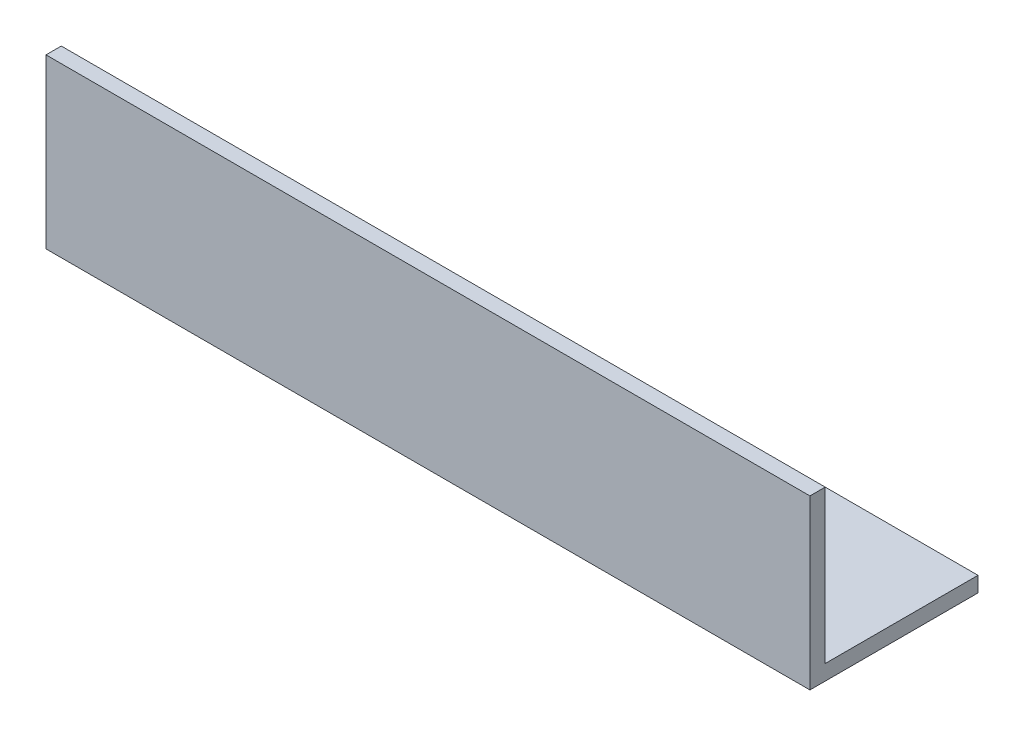
ISO-10303-21;
HEADER;
FILE_DESCRIPTION(('STEP AP214'),'2;1');
FILE_NAME('part.step','',(''),(''),'','','');
FILE_SCHEMA(('AUTOMOTIVE_DESIGN { 1 0 10303 214 1 1 1 1 }'));
ENDSEC;
DATA;
#1=APPLICATION_CONTEXT('core data for automotive mechanical design processes');
#2=APPLICATION_PROTOCOL_DEFINITION('international standard','automotive_design',2000,#1);
#3=PRODUCT_CONTEXT('',#1,'mechanical');
#4=PRODUCT('Part','Part','',(#3));
#5=PRODUCT_RELATED_PRODUCT_CATEGORY('part','',(#4));
#6=PRODUCT_DEFINITION_FORMATION('','',#4);
#7=PRODUCT_DEFINITION_CONTEXT('part definition',#1,'design');
#8=PRODUCT_DEFINITION('design','',#6,#7);
#9=PRODUCT_DEFINITION_SHAPE('','',#8);
#10=(LENGTH_UNIT() NAMED_UNIT(*) SI_UNIT(.MILLI.,.METRE.));
#11=(NAMED_UNIT(*) PLANE_ANGLE_UNIT() SI_UNIT($,.RADIAN.));
#12=(NAMED_UNIT(*) SI_UNIT($,.STERADIAN.) SOLID_ANGLE_UNIT());
#13=UNCERTAINTY_MEASURE_WITH_UNIT(LENGTH_MEASURE(1.E-05),#10,'distance_accuracy_value','');
#14=(GEOMETRIC_REPRESENTATION_CONTEXT(3) GLOBAL_UNCERTAINTY_ASSIGNED_CONTEXT((#13)) GLOBAL_UNIT_ASSIGNED_CONTEXT((#10,
#11,#12)) REPRESENTATION_CONTEXT('',''));
#15=CARTESIAN_POINT('',(0.,0.,0.));
#16=DIRECTION('',(0.,0.,1.));
#17=DIRECTION('',(1.,0.,0.));
#18=AXIS2_PLACEMENT_3D('',#15,#16,#17);
#19=CARTESIAN_POINT('',(150.,-3.,0.));
#20=DIRECTION('',(0.,1.,0.));
#21=DIRECTION('',(0.,0.,1.));
#22=AXIS2_PLACEMENT_3D('',#19,#20,#21);
#23=PLANE('',#22);
#24=DIRECTION('',(0.,0.,-1.));
#25=VECTOR('',#24,1.);
#26=CARTESIAN_POINT('',(0.,-3.,0.));
#27=LINE('',#26,#25);
#28=CARTESIAN_POINT('',(0.,-3.,3.));
#29=VERTEX_POINT('',#28);
#30=CARTESIAN_POINT('',(0.,-3.,-30.));
#31=VERTEX_POINT('',#30);
#32=EDGE_CURVE('E116',#29,#31,#27,.T.);
#33=ORIENTED_EDGE('',*,*,#32,.T.);
#34=DIRECTION('',(-1.,0.,0.));
#35=VECTOR('',#34,1.);
#36=CARTESIAN_POINT('',(150.,-3.,-30.));
#37=LINE('',#36,#35);
#38=CARTESIAN_POINT('',(150.,-3.,-30.));
#39=VERTEX_POINT('',#38);
#40=EDGE_CURVE('E11',#39,#31,#37,.T.);
#41=ORIENTED_EDGE('',*,*,#40,.F.);
#42=DIRECTION('',(0.,0.,-1.));
#43=VECTOR('',#42,1.);
#44=CARTESIAN_POINT('',(150.,-3.,0.));
#45=LINE('',#44,#43);
#46=CARTESIAN_POINT('',(150.,-3.,3.));
#47=VERTEX_POINT('',#46);
#48=EDGE_CURVE('E81',#47,#39,#45,.T.);
#49=ORIENTED_EDGE('',*,*,#48,.F.);
#50=DIRECTION('',(-1.,0.,0.));
#51=VECTOR('',#50,1.);
#52=CARTESIAN_POINT('',(150.,-3.,3.));
#53=LINE('',#52,#51);
#54=EDGE_CURVE('E112',#47,#29,#53,.T.);
#55=ORIENTED_EDGE('',*,*,#54,.T.);
#56=EDGE_LOOP('',(#33,#41,#49,#55));
#57=FACE_BOUND('',#56,.T.);
#58=ADVANCED_FACE('F35',(#57),#23,.F.);
#59=CARTESIAN_POINT('',(150.,0.,-30.));
#60=DIRECTION('',(0.,0.,-1.));
#61=DIRECTION('',(-1.,0.,0.));
#62=AXIS2_PLACEMENT_3D('',#59,#60,#61);
#63=PLANE('',#62);
#64=DIRECTION('',(0.,-1.,0.));
#65=VECTOR('',#64,1.);
#66=CARTESIAN_POINT('',(0.,0.,-30.));
#67=LINE('',#66,#65);
#68=CARTESIAN_POINT('',(0.,0.,-30.));
#69=VERTEX_POINT('',#68);
#70=EDGE_CURVE('E119',#69,#31,#67,.T.);
#71=ORIENTED_EDGE('',*,*,#70,.F.);
#72=DIRECTION('',(-1.,0.,0.));
#73=VECTOR('',#72,1.);
#74=CARTESIAN_POINT('',(150.,0.,-30.));
#75=LINE('',#74,#73);
#76=CARTESIAN_POINT('',(150.,0.,-30.));
#77=VERTEX_POINT('',#76);
#78=EDGE_CURVE('E43',#77,#69,#75,.T.);
#79=ORIENTED_EDGE('',*,*,#78,.F.);
#80=DIRECTION('',(0.,-1.,0.));
#81=VECTOR('',#80,1.);
#82=CARTESIAN_POINT('',(150.,0.,-30.));
#83=LINE('',#82,#81);
#84=EDGE_CURVE('E205',#77,#39,#83,.T.);
#85=ORIENTED_EDGE('',*,*,#84,.T.);
#86=ORIENTED_EDGE('',*,*,#40,.T.);
#87=EDGE_LOOP('',(#71,#79,#85,#86));
#88=FACE_BOUND('',#87,.T.);
#89=ADVANCED_FACE('F137',(#88),#63,.T.);
#90=CARTESIAN_POINT('',(150.,0.,0.));
#91=DIRECTION('',(0.,1.,0.));
#92=DIRECTION('',(0.,0.,1.));
#93=AXIS2_PLACEMENT_3D('',#90,#91,#92);
#94=PLANE('',#93);
#95=DIRECTION('',(0.,0.,-1.));
#96=VECTOR('',#95,1.);
#97=CARTESIAN_POINT('',(0.,0.,0.));
#98=LINE('',#97,#96);
#99=CARTESIAN_POINT('',(0.,0.,0.));
#100=VERTEX_POINT('',#99);
#101=EDGE_CURVE('E122',#100,#69,#98,.T.);
#102=ORIENTED_EDGE('',*,*,#101,.F.);
#103=DIRECTION('',(-1.,0.,0.));
#104=VECTOR('',#103,1.);
#105=CARTESIAN_POINT('',(150.,0.,0.));
#106=LINE('',#105,#104);
#107=CARTESIAN_POINT('',(150.,0.,0.));
#108=VERTEX_POINT('',#107);
#109=EDGE_CURVE('E102',#108,#100,#106,.T.);
#110=ORIENTED_EDGE('',*,*,#109,.F.);
#111=DIRECTION('',(0.,0.,-1.));
#112=VECTOR('',#111,1.);
#113=CARTESIAN_POINT('',(150.,0.,0.));
#114=LINE('',#113,#112);
#115=EDGE_CURVE('E108',#108,#77,#114,.T.);
#116=ORIENTED_EDGE('',*,*,#115,.T.);
#117=ORIENTED_EDGE('',*,*,#78,.T.);
#118=EDGE_LOOP('',(#102,#110,#116,#117));
#119=FACE_BOUND('',#118,.T.);
#120=ADVANCED_FACE('F134',(#119),#94,.T.);
#121=CARTESIAN_POINT('',(150.,30.,0.));
#122=DIRECTION('',(0.,0.,-1.));
#123=DIRECTION('',(0.,1.,0.));
#124=AXIS2_PLACEMENT_3D('',#121,#122,#123);
#125=PLANE('',#124);
#126=DIRECTION('',(0.,-1.,0.));
#127=VECTOR('',#126,1.);
#128=CARTESIAN_POINT('',(0.,30.,0.));
#129=LINE('',#128,#127);
#130=CARTESIAN_POINT('',(0.,30.,0.));
#131=VERTEX_POINT('',#130);
#132=EDGE_CURVE('E97',#131,#100,#129,.T.);
#133=ORIENTED_EDGE('',*,*,#132,.F.);
#134=DIRECTION('',(-1.,0.,0.));
#135=VECTOR('',#134,1.);
#136=CARTESIAN_POINT('',(150.,30.,0.));
#137=LINE('',#136,#135);
#138=CARTESIAN_POINT('',(150.,30.,0.));
#139=VERTEX_POINT('',#138);
#140=EDGE_CURVE('E92',#139,#131,#137,.T.);
#141=ORIENTED_EDGE('',*,*,#140,.F.);
#142=DIRECTION('',(0.,-1.,0.));
#143=VECTOR('',#142,1.);
#144=CARTESIAN_POINT('',(150.,30.,0.));
#145=LINE('',#144,#143);
#146=EDGE_CURVE('E95',#139,#108,#145,.T.);
#147=ORIENTED_EDGE('',*,*,#146,.T.);
#148=ORIENTED_EDGE('',*,*,#109,.T.);
#149=EDGE_LOOP('',(#133,#141,#147,#148));
#150=FACE_BOUND('',#149,.T.);
#151=ADVANCED_FACE('F94',(#150),#125,.T.);
#152=CARTESIAN_POINT('',(150.,30.,3.));
#153=DIRECTION('',(0.,1.,0.));
#154=DIRECTION('',(0.,0.,1.));
#155=AXIS2_PLACEMENT_3D('',#152,#153,#154);
#156=PLANE('',#155);
#157=DIRECTION('',(0.,0.,-1.));
#158=VECTOR('',#157,1.);
#159=CARTESIAN_POINT('',(0.,30.,3.));
#160=LINE('',#159,#158);
#161=CARTESIAN_POINT('',(0.,30.,3.));
#162=VERTEX_POINT('',#161);
#163=EDGE_CURVE('E126',#162,#131,#160,.T.);
#164=ORIENTED_EDGE('',*,*,#163,.F.);
#165=DIRECTION('',(-1.,0.,0.));
#166=VECTOR('',#165,1.);
#167=CARTESIAN_POINT('',(150.,30.,3.));
#168=LINE('',#167,#166);
#169=CARTESIAN_POINT('',(150.,30.,3.));
#170=VERTEX_POINT('',#169);
#171=EDGE_CURVE('E72',#170,#162,#168,.T.);
#172=ORIENTED_EDGE('',*,*,#171,.F.);
#173=DIRECTION('',(0.,0.,-1.));
#174=VECTOR('',#173,1.);
#175=CARTESIAN_POINT('',(150.,30.,3.));
#176=LINE('',#175,#174);
#177=EDGE_CURVE('E106',#170,#139,#176,.T.);
#178=ORIENTED_EDGE('',*,*,#177,.T.);
#179=ORIENTED_EDGE('',*,*,#140,.T.);
#180=EDGE_LOOP('',(#164,#172,#178,#179));
#181=FACE_BOUND('',#180,.T.);
#182=ADVANCED_FACE('F110',(#181),#156,.T.);
#183=CARTESIAN_POINT('',(150.,30.,3.));
#184=DIRECTION('',(0.,0.,-1.));
#185=DIRECTION('',(0.,1.,0.));
#186=AXIS2_PLACEMENT_3D('',#183,#184,#185);
#187=PLANE('',#186);
#188=DIRECTION('',(0.,-1.,0.));
#189=VECTOR('',#188,1.);
#190=CARTESIAN_POINT('',(0.,30.,3.));
#191=LINE('',#190,#189);
#192=EDGE_CURVE('E75',#162,#29,#191,.T.);
#193=ORIENTED_EDGE('',*,*,#192,.T.);
#194=ORIENTED_EDGE('',*,*,#54,.F.);
#195=DIRECTION('',(0.,-1.,0.));
#196=VECTOR('',#195,1.);
#197=CARTESIAN_POINT('',(150.,30.,3.));
#198=LINE('',#197,#196);
#199=EDGE_CURVE('E51',#170,#47,#198,.T.);
#200=ORIENTED_EDGE('',*,*,#199,.F.);
#201=ORIENTED_EDGE('',*,*,#171,.T.);
#202=EDGE_LOOP('',(#193,#194,#200,#201));
#203=FACE_BOUND('',#202,.T.);
#204=ADVANCED_FACE('F142',(#203),#187,.F.);
#205=CARTESIAN_POINT('',(150.,0.,0.));
#206=DIRECTION('',(-1.,0.,0.));
#207=DIRECTION('',(0.,0.,1.));
#208=AXIS2_PLACEMENT_3D('',#205,#206,#207);
#209=PLANE('',#208);
#210=ORIENTED_EDGE('',*,*,#48,.T.);
#211=ORIENTED_EDGE('',*,*,#84,.F.);
#212=ORIENTED_EDGE('',*,*,#115,.F.);
#213=ORIENTED_EDGE('',*,*,#146,.F.);
#214=ORIENTED_EDGE('',*,*,#177,.F.);
#215=ORIENTED_EDGE('',*,*,#199,.T.);
#216=EDGE_LOOP('',(#210,#211,#212,#213,#214,#215));
#217=FACE_BOUND('',#216,.T.);
#218=ADVANCED_FACE('F105',(#217),#209,.F.);
#219=CARTESIAN_POINT('',(0.,0.,0.));
#220=DIRECTION('',(-1.,0.,0.));
#221=DIRECTION('',(0.,0.,1.));
#222=AXIS2_PLACEMENT_3D('',#219,#220,#221);
#223=PLANE('',#222);
#224=ORIENTED_EDGE('',*,*,#32,.F.);
#225=ORIENTED_EDGE('',*,*,#192,.F.);
#226=ORIENTED_EDGE('',*,*,#163,.T.);
#227=ORIENTED_EDGE('',*,*,#132,.T.);
#228=ORIENTED_EDGE('',*,*,#101,.T.);
#229=ORIENTED_EDGE('',*,*,#70,.T.);
#230=EDGE_LOOP('',(#224,#225,#226,#227,#228,#229));
#231=FACE_BOUND('',#230,.T.);
#232=ADVANCED_FACE('F140',(#231),#223,.T.);
#233=CLOSED_SHELL('',(#58,#89,#120,#151,#182,#204,#218,#232));
#234=MANIFOLD_SOLID_BREP('B2',#233);
#235=ADVANCED_BREP_SHAPE_REPRESENTATION('',(#18,#234),#14);
#236=SHAPE_DEFINITION_REPRESENTATION(#9,#235);
ENDSEC;
END-ISO-10303-21;
